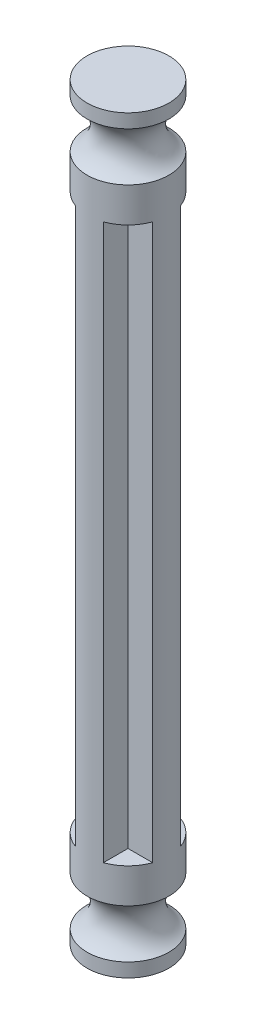
ISO-10303-21;
HEADER;
FILE_DESCRIPTION(('STEP AP214'),'2;1');
FILE_NAME('part.step','',(''),(''),'','','');
FILE_SCHEMA(('AUTOMOTIVE_DESIGN { 1 0 10303 214 1 1 1 1 }'));
ENDSEC;
DATA;
#1=APPLICATION_CONTEXT('core data for automotive mechanical design processes');
#2=APPLICATION_PROTOCOL_DEFINITION('international standard','automotive_design',2000,#1);
#3=PRODUCT_CONTEXT('',#1,'mechanical');
#4=PRODUCT('Part','Part','',(#3));
#5=PRODUCT_RELATED_PRODUCT_CATEGORY('part','',(#4));
#6=PRODUCT_DEFINITION_FORMATION('','',#4);
#7=PRODUCT_DEFINITION_CONTEXT('part definition',#1,'design');
#8=PRODUCT_DEFINITION('design','',#6,#7);
#9=PRODUCT_DEFINITION_SHAPE('','',#8);
#10=(LENGTH_UNIT() NAMED_UNIT(*) SI_UNIT(.MILLI.,.METRE.));
#11=(NAMED_UNIT(*) PLANE_ANGLE_UNIT() SI_UNIT($,.RADIAN.));
#12=(NAMED_UNIT(*) SI_UNIT($,.STERADIAN.) SOLID_ANGLE_UNIT());
#13=UNCERTAINTY_MEASURE_WITH_UNIT(LENGTH_MEASURE(1.E-05),#10,'distance_accuracy_value','');
#14=(GEOMETRIC_REPRESENTATION_CONTEXT(3) GLOBAL_UNCERTAINTY_ASSIGNED_CONTEXT((#13)) GLOBAL_UNIT_ASSIGNED_CONTEXT((#10,
#11,#12)) REPRESENTATION_CONTEXT('',''));
#15=CARTESIAN_POINT('',(0.,0.,0.));
#16=DIRECTION('',(0.,0.,1.));
#17=DIRECTION('',(1.,0.,0.));
#18=AXIS2_PLACEMENT_3D('',#15,#16,#17);
#19=CARTESIAN_POINT('',(1.,40.,1.));
#20=DIRECTION('',(-1.,0.,0.));
#21=DIRECTION('',(0.,0.,1.));
#22=AXIS2_PLACEMENT_3D('',#19,#20,#21);
#23=PLANE('',#22);
#24=DIRECTION('',(0.,0.,-1.));
#25=VECTOR('',#24,1.);
#26=CARTESIAN_POINT('',(1.,0.,1.));
#27=LINE('',#26,#25);
#28=CARTESIAN_POINT('',(1.,0.,2.77533781727558));
#29=VERTEX_POINT('',#28);
#30=CARTESIAN_POINT('',(1.,0.,1.));
#31=VERTEX_POINT('',#30);
#32=EDGE_CURVE('E122',#29,#31,#27,.T.);
#33=ORIENTED_EDGE('',*,*,#32,.T.);
#34=DIRECTION('',(0.,-1.,0.));
#35=VECTOR('',#34,1.);
#36=CARTESIAN_POINT('',(1.,40.,1.));
#37=LINE('',#36,#35);
#38=CARTESIAN_POINT('',(1.,40.,1.));
#39=VERTEX_POINT('',#38);
#40=EDGE_CURVE('E11',#39,#31,#37,.T.);
#41=ORIENTED_EDGE('',*,*,#40,.F.);
#42=DIRECTION('',(0.,0.,-1.));
#43=VECTOR('',#42,1.);
#44=CARTESIAN_POINT('',(1.,40.,1.));
#45=LINE('',#44,#43);
#46=CARTESIAN_POINT('',(0.999999999999999,40.,2.77533781727558));
#47=VERTEX_POINT('',#46);
#48=EDGE_CURVE('E139',#47,#39,#45,.T.);
#49=ORIENTED_EDGE('',*,*,#48,.F.);
#50=DIRECTION('',(0.,-1.,0.));
#51=VECTOR('',#50,1.);
#52=CARTESIAN_POINT('',(0.999999999999999,40.,2.77533781727558));
#53=LINE('',#52,#51);
#54=EDGE_CURVE('E52',#47,#29,#53,.T.);
#55=ORIENTED_EDGE('',*,*,#54,.T.);
#56=EDGE_LOOP('',(#33,#41,#49,#55));
#57=FACE_BOUND('',#56,.T.);
#58=ADVANCED_FACE('F37',(#57),#23,.F.);
#59=CARTESIAN_POINT('',(1.,40.,1.));
#60=DIRECTION('',(0.,0.,-1.));
#61=DIRECTION('',(-1.,0.,0.));
#62=AXIS2_PLACEMENT_3D('',#59,#60,#61);
#63=PLANE('',#62);
#64=DIRECTION('',(1.,0.,0.));
#65=VECTOR('',#64,1.);
#66=CARTESIAN_POINT('',(1.,0.,1.));
#67=LINE('',#66,#65);
#68=CARTESIAN_POINT('',(2.77533781727558,0.,1.));
#69=VERTEX_POINT('',#68);
#70=EDGE_CURVE('E126',#31,#69,#67,.T.);
#71=ORIENTED_EDGE('',*,*,#70,.T.);
#72=DIRECTION('',(0.,-1.,0.));
#73=VECTOR('',#72,1.);
#74=CARTESIAN_POINT('',(2.77533781727558,40.,1.));
#75=LINE('',#74,#73);
#76=CARTESIAN_POINT('',(2.77533781727558,40.,1.));
#77=VERTEX_POINT('',#76);
#78=EDGE_CURVE('E45',#77,#69,#75,.T.);
#79=ORIENTED_EDGE('',*,*,#78,.F.);
#80=DIRECTION('',(1.,0.,0.));
#81=VECTOR('',#80,1.);
#82=CARTESIAN_POINT('',(1.,40.,1.));
#83=LINE('',#82,#81);
#84=EDGE_CURVE('E213',#39,#77,#83,.T.);
#85=ORIENTED_EDGE('',*,*,#84,.F.);
#86=ORIENTED_EDGE('',*,*,#40,.T.);
#87=EDGE_LOOP('',(#71,#79,#85,#86));
#88=FACE_BOUND('',#87,.T.);
#89=ADVANCED_FACE('F277',(#88),#63,.F.);
#90=CARTESIAN_POINT('',(1.,40.,-1.));
#91=DIRECTION('',(0.,0.,1.));
#92=DIRECTION('',(1.,0.,0.));
#93=AXIS2_PLACEMENT_3D('',#90,#91,#92);
#94=PLANE('',#93);
#95=DIRECTION('',(-1.,0.,0.));
#96=VECTOR('',#95,1.);
#97=CARTESIAN_POINT('',(1.,0.,-1.));
#98=LINE('',#97,#96);
#99=CARTESIAN_POINT('',(2.77533781727558,0.,-1.));
#100=VERTEX_POINT('',#99);
#101=CARTESIAN_POINT('',(1.,0.,-1.));
#102=VERTEX_POINT('',#101);
#103=EDGE_CURVE('E180',#100,#102,#98,.T.);
#104=ORIENTED_EDGE('',*,*,#103,.T.);
#105=DIRECTION('',(0.,-1.,0.));
#106=VECTOR('',#105,1.);
#107=CARTESIAN_POINT('',(1.,40.,-1.));
#108=LINE('',#107,#106);
#109=CARTESIAN_POINT('',(1.,40.,-1.));
#110=VERTEX_POINT('',#109);
#111=EDGE_CURVE('E171',#110,#102,#108,.T.);
#112=ORIENTED_EDGE('',*,*,#111,.F.);
#113=DIRECTION('',(-1.,0.,0.));
#114=VECTOR('',#113,1.);
#115=CARTESIAN_POINT('',(1.,40.,-1.));
#116=LINE('',#115,#114);
#117=CARTESIAN_POINT('',(2.77533781727558,40.,-1.));
#118=VERTEX_POINT('',#117);
#119=EDGE_CURVE('E182',#118,#110,#116,.T.);
#120=ORIENTED_EDGE('',*,*,#119,.F.);
#121=DIRECTION('',(0.,-1.,0.));
#122=VECTOR('',#121,1.);
#123=CARTESIAN_POINT('',(2.77533781727558,40.,-1.));
#124=LINE('',#123,#122);
#125=EDGE_CURVE('E174',#118,#100,#124,.T.);
#126=ORIENTED_EDGE('',*,*,#125,.T.);
#127=EDGE_LOOP('',(#104,#112,#120,#126));
#128=FACE_BOUND('',#127,.T.);
#129=ADVANCED_FACE('F179',(#128),#94,.F.);
#130=CARTESIAN_POINT('',(1.,40.,-1.));
#131=DIRECTION('',(-1.,0.,0.));
#132=DIRECTION('',(0.,0.,1.));
#133=AXIS2_PLACEMENT_3D('',#130,#131,#132);
#134=PLANE('',#133);
#135=DIRECTION('',(0.,0.,-1.));
#136=VECTOR('',#135,1.);
#137=CARTESIAN_POINT('',(1.,0.,-1.));
#138=LINE('',#137,#136);
#139=CARTESIAN_POINT('',(0.999999999999999,0.,-2.77533781727558));
#140=VERTEX_POINT('',#139);
#141=EDGE_CURVE('E230',#102,#140,#138,.T.);
#142=ORIENTED_EDGE('',*,*,#141,.T.);
#143=DIRECTION('',(0.,-1.,0.));
#144=VECTOR('',#143,1.);
#145=CARTESIAN_POINT('',(1.,40.,-2.77533781727558));
#146=LINE('',#145,#144);
#147=CARTESIAN_POINT('',(1.,40.,-2.77533781727558));
#148=VERTEX_POINT('',#147);
#149=EDGE_CURVE('E168',#148,#140,#146,.T.);
#150=ORIENTED_EDGE('',*,*,#149,.F.);
#151=DIRECTION('',(0.,0.,-1.));
#152=VECTOR('',#151,1.);
#153=CARTESIAN_POINT('',(1.,40.,-1.));
#154=LINE('',#153,#152);
#155=EDGE_CURVE('E217',#110,#148,#154,.T.);
#156=ORIENTED_EDGE('',*,*,#155,.F.);
#157=ORIENTED_EDGE('',*,*,#111,.T.);
#158=EDGE_LOOP('',(#142,#150,#156,#157));
#159=FACE_BOUND('',#158,.T.);
#160=ADVANCED_FACE('F266',(#159),#134,.F.);
#161=CARTESIAN_POINT('',(-1.,40.,-1.));
#162=DIRECTION('',(1.,0.,0.));
#163=DIRECTION('',(0.,0.,-1.));
#164=AXIS2_PLACEMENT_3D('',#161,#162,#163);
#165=PLANE('',#164);
#166=DIRECTION('',(0.,0.,1.));
#167=VECTOR('',#166,1.);
#168=CARTESIAN_POINT('',(-1.,0.,-1.));
#169=LINE('',#168,#167);
#170=CARTESIAN_POINT('',(-1.,0.,-2.77533781727558));
#171=VERTEX_POINT('',#170);
#172=CARTESIAN_POINT('',(-1.,0.,-1.));
#173=VERTEX_POINT('',#172);
#174=EDGE_CURVE('E232',#171,#173,#169,.T.);
#175=ORIENTED_EDGE('',*,*,#174,.T.);
#176=DIRECTION('',(0.,-1.,0.));
#177=VECTOR('',#176,1.);
#178=CARTESIAN_POINT('',(-1.,40.,-1.));
#179=LINE('',#178,#177);
#180=CARTESIAN_POINT('',(-1.,40.,-1.));
#181=VERTEX_POINT('',#180);
#182=EDGE_CURVE('E162',#181,#173,#179,.T.);
#183=ORIENTED_EDGE('',*,*,#182,.F.);
#184=DIRECTION('',(0.,0.,1.));
#185=VECTOR('',#184,1.);
#186=CARTESIAN_POINT('',(-1.,40.,-1.));
#187=LINE('',#186,#185);
#188=CARTESIAN_POINT('',(-1.,40.,-2.77533781727558));
#189=VERTEX_POINT('',#188);
#190=EDGE_CURVE('E220',#189,#181,#187,.T.);
#191=ORIENTED_EDGE('',*,*,#190,.F.);
#192=DIRECTION('',(0.,-1.,0.));
#193=VECTOR('',#192,1.);
#194=CARTESIAN_POINT('',(-1.,40.,-2.77533781727558));
#195=LINE('',#194,#193);
#196=EDGE_CURVE('E165',#189,#171,#195,.T.);
#197=ORIENTED_EDGE('',*,*,#196,.T.);
#198=EDGE_LOOP('',(#175,#183,#191,#197));
#199=FACE_BOUND('',#198,.T.);
#200=ADVANCED_FACE('F264',(#199),#165,.F.);
#201=CARTESIAN_POINT('',(-1.,40.,-1.));
#202=DIRECTION('',(0.,0.,1.));
#203=DIRECTION('',(1.,0.,0.));
#204=AXIS2_PLACEMENT_3D('',#201,#202,#203);
#205=PLANE('',#204);
#206=DIRECTION('',(-1.,0.,0.));
#207=VECTOR('',#206,1.);
#208=CARTESIAN_POINT('',(-1.,0.,-1.));
#209=LINE('',#208,#207);
#210=CARTESIAN_POINT('',(-2.77533781727558,0.,-1.));
#211=VERTEX_POINT('',#210);
#212=EDGE_CURVE('E235',#173,#211,#209,.T.);
#213=ORIENTED_EDGE('',*,*,#212,.T.);
#214=DIRECTION('',(0.,-1.,0.));
#215=VECTOR('',#214,1.);
#216=CARTESIAN_POINT('',(-2.77533781727558,40.,-1.));
#217=LINE('',#216,#215);
#218=CARTESIAN_POINT('',(-2.77533781727558,40.,-1.));
#219=VERTEX_POINT('',#218);
#220=EDGE_CURVE('E159',#219,#211,#217,.T.);
#221=ORIENTED_EDGE('',*,*,#220,.F.);
#222=DIRECTION('',(-1.,0.,0.));
#223=VECTOR('',#222,1.);
#224=CARTESIAN_POINT('',(-1.,40.,-1.));
#225=LINE('',#224,#223);
#226=EDGE_CURVE('E223',#181,#219,#225,.T.);
#227=ORIENTED_EDGE('',*,*,#226,.F.);
#228=ORIENTED_EDGE('',*,*,#182,.T.);
#229=EDGE_LOOP('',(#213,#221,#227,#228));
#230=FACE_BOUND('',#229,.T.);
#231=ADVANCED_FACE('F260',(#230),#205,.F.);
#232=CARTESIAN_POINT('',(-1.,40.,1.));
#233=DIRECTION('',(0.,0.,-1.));
#234=DIRECTION('',(-1.,0.,0.));
#235=AXIS2_PLACEMENT_3D('',#232,#233,#234);
#236=PLANE('',#235);
#237=DIRECTION('',(1.,0.,0.));
#238=VECTOR('',#237,1.);
#239=CARTESIAN_POINT('',(-1.,0.,1.));
#240=LINE('',#239,#238);
#241=CARTESIAN_POINT('',(-2.77533781727558,0.,1.));
#242=VERTEX_POINT('',#241);
#243=CARTESIAN_POINT('',(-1.,0.,1.));
#244=VERTEX_POINT('',#243);
#245=EDGE_CURVE('E237',#242,#244,#240,.T.);
#246=ORIENTED_EDGE('',*,*,#245,.T.);
#247=DIRECTION('',(0.,-1.,0.));
#248=VECTOR('',#247,1.);
#249=CARTESIAN_POINT('',(-1.,40.,1.));
#250=LINE('',#249,#248);
#251=CARTESIAN_POINT('',(-1.,40.,1.));
#252=VERTEX_POINT('',#251);
#253=EDGE_CURVE('E145',#252,#244,#250,.T.);
#254=ORIENTED_EDGE('',*,*,#253,.F.);
#255=DIRECTION('',(1.,0.,0.));
#256=VECTOR('',#255,1.);
#257=CARTESIAN_POINT('',(-1.,40.,1.));
#258=LINE('',#257,#256);
#259=CARTESIAN_POINT('',(-2.77533781727558,40.,0.999999999999999));
#260=VERTEX_POINT('',#259);
#261=EDGE_CURVE('E148',#260,#252,#258,.T.);
#262=ORIENTED_EDGE('',*,*,#261,.F.);
#263=DIRECTION('',(0.,-1.,0.));
#264=VECTOR('',#263,1.);
#265=CARTESIAN_POINT('',(-2.77533781727558,40.,0.999999999999999));
#266=LINE('',#265,#264);
#267=EDGE_CURVE('E156',#260,#242,#266,.T.);
#268=ORIENTED_EDGE('',*,*,#267,.T.);
#269=EDGE_LOOP('',(#246,#254,#262,#268));
#270=FACE_BOUND('',#269,.T.);
#271=ADVANCED_FACE('F272',(#270),#236,.F.);
#272=CARTESIAN_POINT('',(-1.,40.,1.));
#273=DIRECTION('',(1.,0.,0.));
#274=DIRECTION('',(0.,0.,-1.));
#275=AXIS2_PLACEMENT_3D('',#272,#273,#274);
#276=PLANE('',#275);
#277=DIRECTION('',(0.,0.,1.));
#278=VECTOR('',#277,1.);
#279=CARTESIAN_POINT('',(-1.,0.,1.));
#280=LINE('',#279,#278);
#281=CARTESIAN_POINT('',(-0.999999999999999,0.,2.77533781727558));
#282=VERTEX_POINT('',#281);
#283=EDGE_CURVE('E151',#244,#282,#280,.T.);
#284=ORIENTED_EDGE('',*,*,#283,.T.);
#285=DIRECTION('',(0.,-1.,0.));
#286=VECTOR('',#285,1.);
#287=CARTESIAN_POINT('',(-1.,40.,2.77533781727558));
#288=LINE('',#287,#286);
#289=CARTESIAN_POINT('',(-0.999999999999999,40.,2.77533781727559));
#290=VERTEX_POINT('',#289);
#291=EDGE_CURVE('E141',#290,#282,#288,.T.);
#292=ORIENTED_EDGE('',*,*,#291,.F.);
#293=DIRECTION('',(0.,0.,1.));
#294=VECTOR('',#293,1.);
#295=CARTESIAN_POINT('',(-1.,40.,1.));
#296=LINE('',#295,#294);
#297=EDGE_CURVE('E142',#252,#290,#296,.T.);
#298=ORIENTED_EDGE('',*,*,#297,.F.);
#299=ORIENTED_EDGE('',*,*,#253,.T.);
#300=EDGE_LOOP('',(#284,#292,#298,#299));
#301=FACE_BOUND('',#300,.T.);
#302=ADVANCED_FACE('F242',(#301),#276,.F.);
#303=CARTESIAN_POINT('',(0.,40.,0.));
#304=DIRECTION('',(0.,-1.,0.));
#305=DIRECTION('',(0.,0.,-1.));
#306=AXIS2_PLACEMENT_3D('',#303,#304,#305);
#307=CYLINDRICAL_SURFACE('',#306,2.95);
#308=CARTESIAN_POINT('',(0.,0.,0.));
#309=DIRECTION('',(0.,1.,0.));
#310=DIRECTION('',(0.,0.,1.));
#311=AXIS2_PLACEMENT_3D('',#308,#309,#310);
#312=CIRCLE('',#311,2.95);
#313=EDGE_CURVE('E124',#29,#69,#312,.T.);
#314=ORIENTED_EDGE('',*,*,#313,.F.);
#315=ORIENTED_EDGE('',*,*,#54,.F.);
#316=CARTESIAN_POINT('',(0.,40.,0.));
#317=DIRECTION('',(0.,1.,0.));
#318=DIRECTION('',(0.,0.,1.));
#319=AXIS2_PLACEMENT_3D('',#316,#317,#318);
#320=CIRCLE('',#319,2.95000000000001);
#321=EDGE_CURVE('E129',#47,#77,#320,.T.);
#322=ORIENTED_EDGE('',*,*,#321,.T.);
#323=ORIENTED_EDGE('',*,*,#78,.T.);
#324=EDGE_LOOP('',(#314,#315,#322,#323));
#325=FACE_BOUND('',#324,.T.);
#326=EDGE_CURVE('E137',#242,#282,#312,.T.);
#327=ORIENTED_EDGE('',*,*,#326,.F.);
#328=ORIENTED_EDGE('',*,*,#267,.F.);
#329=EDGE_CURVE('E210',#260,#290,#320,.T.);
#330=ORIENTED_EDGE('',*,*,#329,.T.);
#331=ORIENTED_EDGE('',*,*,#291,.T.);
#332=EDGE_LOOP('',(#327,#328,#330,#331));
#333=FACE_BOUND('',#332,.T.);
#334=EDGE_CURVE('E191',#171,#211,#312,.T.);
#335=ORIENTED_EDGE('',*,*,#334,.F.);
#336=ORIENTED_EDGE('',*,*,#196,.F.);
#337=EDGE_CURVE('E251',#189,#219,#320,.T.);
#338=ORIENTED_EDGE('',*,*,#337,.T.);
#339=ORIENTED_EDGE('',*,*,#220,.T.);
#340=EDGE_LOOP('',(#335,#336,#338,#339));
#341=FACE_BOUND('',#340,.T.);
#342=ORIENTED_EDGE('',*,*,#149,.T.);
#343=EDGE_CURVE('E135',#100,#140,#312,.T.);
#344=ORIENTED_EDGE('',*,*,#343,.F.);
#345=ORIENTED_EDGE('',*,*,#125,.F.);
#346=EDGE_CURVE('E188',#118,#148,#320,.T.);
#347=ORIENTED_EDGE('',*,*,#346,.T.);
#348=EDGE_LOOP('',(#342,#344,#345,#347));
#349=FACE_BOUND('',#348,.T.);
#350=CARTESIAN_POINT('',(0.,42.5,0.));
#351=DIRECTION('',(0.,1.,0.));
#352=DIRECTION('',(0.,0.,1.));
#353=AXIS2_PLACEMENT_3D('',#350,#351,#352);
#354=CIRCLE('',#353,2.95);
#355=CARTESIAN_POINT('',(0.,42.5,2.95000000000001));
#356=VERTEX_POINT('',#355);
#357=EDGE_CURVE('E207',#356,#356,#354,.T.);
#358=ORIENTED_EDGE('',*,*,#357,.F.);
#359=EDGE_LOOP('',(#358));
#360=FACE_BOUND('',#359,.T.);
#361=CARTESIAN_POINT('',(0.,-2.5,0.));
#362=DIRECTION('',(0.,1.,0.));
#363=DIRECTION('',(0.,0.,1.));
#364=AXIS2_PLACEMENT_3D('',#361,#362,#363);
#365=CIRCLE('',#364,2.95);
#366=CARTESIAN_POINT('',(0.,-2.5,2.95));
#367=VERTEX_POINT('',#366);
#368=EDGE_CURVE('E134',#367,#367,#365,.T.);
#369=ORIENTED_EDGE('',*,*,#368,.T.);
#370=EDGE_LOOP('',(#369));
#371=FACE_BOUND('',#370,.T.);
#372=ADVANCED_FACE('F132',(#325,#333,#341,#349,#360,#371),#307,.T.);
#373=CARTESIAN_POINT('',(0.,40.,0.));
#374=DIRECTION('',(0.,1.,0.));
#375=DIRECTION('',(0.,0.,1.));
#376=AXIS2_PLACEMENT_3D('',#373,#374,#375);
#377=PLANE('',#376);
#378=ORIENTED_EDGE('',*,*,#321,.F.);
#379=ORIENTED_EDGE('',*,*,#48,.T.);
#380=ORIENTED_EDGE('',*,*,#84,.T.);
#381=EDGE_LOOP('',(#378,#379,#380));
#382=FACE_BOUND('',#381,.T.);
#383=ADVANCED_FACE('F287',(#382),#377,.F.);
#384=ORIENTED_EDGE('',*,*,#346,.F.);
#385=ORIENTED_EDGE('',*,*,#119,.T.);
#386=ORIENTED_EDGE('',*,*,#155,.T.);
#387=EDGE_LOOP('',(#384,#385,#386));
#388=FACE_BOUND('',#387,.T.);
#389=ADVANCED_FACE('F289',(#388),#377,.F.);
#390=ORIENTED_EDGE('',*,*,#337,.F.);
#391=ORIENTED_EDGE('',*,*,#190,.T.);
#392=ORIENTED_EDGE('',*,*,#226,.T.);
#393=EDGE_LOOP('',(#390,#391,#392));
#394=FACE_BOUND('',#393,.T.);
#395=ADVANCED_FACE('F257',(#394),#377,.F.);
#396=ORIENTED_EDGE('',*,*,#329,.F.);
#397=ORIENTED_EDGE('',*,*,#261,.T.);
#398=ORIENTED_EDGE('',*,*,#297,.T.);
#399=EDGE_LOOP('',(#396,#397,#398));
#400=FACE_BOUND('',#399,.T.);
#401=ADVANCED_FACE('F291',(#400),#377,.F.);
#402=CARTESIAN_POINT('',(0.,44.25,0.));
#403=DIRECTION('',(0.,1.,0.));
#404=DIRECTION('',(0.,0.,1.));
#405=AXIS2_PLACEMENT_3D('',#402,#403,#404);
#406=TOROIDAL_SURFACE('',#405,3.91824583655186,2.);
#407=CARTESIAN_POINT('',(0.,46.,0.));
#408=DIRECTION('',(0.,1.,0.));
#409=DIRECTION('',(0.,0.,1.));
#410=AXIS2_PLACEMENT_3D('',#407,#408,#409);
#411=CIRCLE('',#410,2.95000000000001);
#412=CARTESIAN_POINT('',(0.,46.,2.95000000000001));
#413=VERTEX_POINT('',#412);
#414=EDGE_CURVE('E204',#413,#413,#411,.T.);
#415=ORIENTED_EDGE('',*,*,#414,.F.);
#416=EDGE_LOOP('',(#415));
#417=FACE_BOUND('',#416,.T.);
#418=ORIENTED_EDGE('',*,*,#357,.T.);
#419=EDGE_LOOP('',(#418));
#420=FACE_BOUND('',#419,.T.);
#421=ADVANCED_FACE('F300',(#417,#420),#406,.F.);
#422=CARTESIAN_POINT('',(0.,0.,0.));
#423=DIRECTION('',(0.,1.,0.));
#424=DIRECTION('',(0.,0.,1.));
#425=AXIS2_PLACEMENT_3D('',#422,#423,#424);
#426=CYLINDRICAL_SURFACE('',#425,2.95000000000001);
#427=CARTESIAN_POINT('',(0.,47.,0.));
#428=DIRECTION('',(0.,1.,0.));
#429=DIRECTION('',(0.,0.,1.));
#430=AXIS2_PLACEMENT_3D('',#427,#428,#429);
#431=CIRCLE('',#430,2.95000000000001);
#432=CARTESIAN_POINT('',(0.,47.,2.95000000000001));
#433=VERTEX_POINT('',#432);
#434=EDGE_CURVE('E201',#433,#433,#431,.T.);
#435=ORIENTED_EDGE('',*,*,#434,.F.);
#436=EDGE_LOOP('',(#435));
#437=FACE_BOUND('',#436,.T.);
#438=ORIENTED_EDGE('',*,*,#414,.T.);
#439=EDGE_LOOP('',(#438));
#440=FACE_BOUND('',#439,.T.);
#441=ADVANCED_FACE('F305',(#437,#440),#426,.T.);
#442=CARTESIAN_POINT('',(0.,47.,0.));
#443=DIRECTION('',(0.,-1.,0.));
#444=DIRECTION('',(0.,0.,-1.));
#445=AXIS2_PLACEMENT_3D('',#442,#443,#444);
#446=PLANE('',#445);
#447=ORIENTED_EDGE('',*,*,#434,.T.);
#448=EDGE_LOOP('',(#447));
#449=FACE_BOUND('',#448,.T.);
#450=ADVANCED_FACE('F405',(#449),#446,.F.);
#451=CARTESIAN_POINT('',(0.,0.,0.));
#452=DIRECTION('',(0.,-1.,0.));
#453=DIRECTION('',(0.,0.,-1.));
#454=AXIS2_PLACEMENT_3D('',#451,#452,#453);
#455=PLANE('',#454);
#456=ORIENTED_EDGE('',*,*,#283,.F.);
#457=ORIENTED_EDGE('',*,*,#245,.F.);
#458=ORIENTED_EDGE('',*,*,#326,.T.);
#459=EDGE_LOOP('',(#456,#457,#458));
#460=FACE_BOUND('',#459,.T.);
#461=ADVANCED_FACE('F414',(#460),#455,.F.);
#462=ORIENTED_EDGE('',*,*,#212,.F.);
#463=ORIENTED_EDGE('',*,*,#174,.F.);
#464=ORIENTED_EDGE('',*,*,#334,.T.);
#465=EDGE_LOOP('',(#462,#463,#464));
#466=FACE_BOUND('',#465,.T.);
#467=ADVANCED_FACE('F262',(#466),#455,.F.);
#468=ORIENTED_EDGE('',*,*,#141,.F.);
#469=ORIENTED_EDGE('',*,*,#103,.F.);
#470=ORIENTED_EDGE('',*,*,#343,.T.);
#471=EDGE_LOOP('',(#468,#469,#470));
#472=FACE_BOUND('',#471,.T.);
#473=ADVANCED_FACE('F430',(#472),#455,.F.);
#474=ORIENTED_EDGE('',*,*,#32,.F.);
#475=ORIENTED_EDGE('',*,*,#313,.T.);
#476=ORIENTED_EDGE('',*,*,#70,.F.);
#477=EDGE_LOOP('',(#474,#475,#476));
#478=FACE_BOUND('',#477,.T.);
#479=ADVANCED_FACE('F123',(#478),#455,.F.);
#480=CARTESIAN_POINT('',(0.,-7.,0.));
#481=DIRECTION('',(0.,1.,0.));
#482=DIRECTION('',(0.,0.,1.));
#483=AXIS2_PLACEMENT_3D('',#480,#481,#482);
#484=PLANE('',#483);
#485=CARTESIAN_POINT('',(0.,-7.,0.));
#486=DIRECTION('',(0.,1.,0.));
#487=DIRECTION('',(0.,0.,1.));
#488=AXIS2_PLACEMENT_3D('',#485,#486,#487);
#489=CIRCLE('',#488,2.95);
#490=CARTESIAN_POINT('',(0.,-7.,2.95));
#491=VERTEX_POINT('',#490);
#492=EDGE_CURVE('E198',#491,#491,#489,.T.);
#493=ORIENTED_EDGE('',*,*,#492,.F.);
#494=EDGE_LOOP('',(#493));
#495=FACE_BOUND('',#494,.T.);
#496=ADVANCED_FACE('F443',(#495),#484,.F.);
#497=CARTESIAN_POINT('',(0.,0.,0.));
#498=DIRECTION('',(0.,1.,0.));
#499=DIRECTION('',(0.,0.,1.));
#500=AXIS2_PLACEMENT_3D('',#497,#498,#499);
#501=CYLINDRICAL_SURFACE('',#500,2.95);
#502=CARTESIAN_POINT('',(0.,-6.,0.));
#503=DIRECTION('',(0.,1.,0.));
#504=DIRECTION('',(0.,0.,1.));
#505=AXIS2_PLACEMENT_3D('',#502,#503,#504);
#506=CIRCLE('',#505,2.95);
#507=CARTESIAN_POINT('',(0.,-6.,2.95));
#508=VERTEX_POINT('',#507);
#509=EDGE_CURVE('E195',#508,#508,#506,.T.);
#510=ORIENTED_EDGE('',*,*,#509,.F.);
#511=EDGE_LOOP('',(#510));
#512=FACE_BOUND('',#511,.T.);
#513=ORIENTED_EDGE('',*,*,#492,.T.);
#514=EDGE_LOOP('',(#513));
#515=FACE_BOUND('',#514,.T.);
#516=ADVANCED_FACE('F450',(#512,#515),#501,.T.);
#517=CARTESIAN_POINT('',(0.,-4.25,0.));
#518=DIRECTION('',(0.,1.,0.));
#519=DIRECTION('',(0.,0.,1.));
#520=AXIS2_PLACEMENT_3D('',#517,#518,#519);
#521=TOROIDAL_SURFACE('',#520,3.91824583655185,2.);
#522=ORIENTED_EDGE('',*,*,#368,.F.);
#523=EDGE_LOOP('',(#522));
#524=FACE_BOUND('',#523,.T.);
#525=ORIENTED_EDGE('',*,*,#509,.T.);
#526=EDGE_LOOP('',(#525));
#527=FACE_BOUND('',#526,.T.);
#528=ADVANCED_FACE('F459',(#524,#527),#521,.F.);
#529=CLOSED_SHELL('',(#58,#89,#129,#160,#200,#231,#271,#302,#372,#383,#389,#395,#401,#421,#441,
#450,#461,#467,#473,#479,#496,#516,#528));
#530=MANIFOLD_SOLID_BREP('B2',#529);
#531=ADVANCED_BREP_SHAPE_REPRESENTATION('',(#18,#530),#14);
#532=SHAPE_DEFINITION_REPRESENTATION(#9,#531);
ENDSEC;
END-ISO-10303-21;
